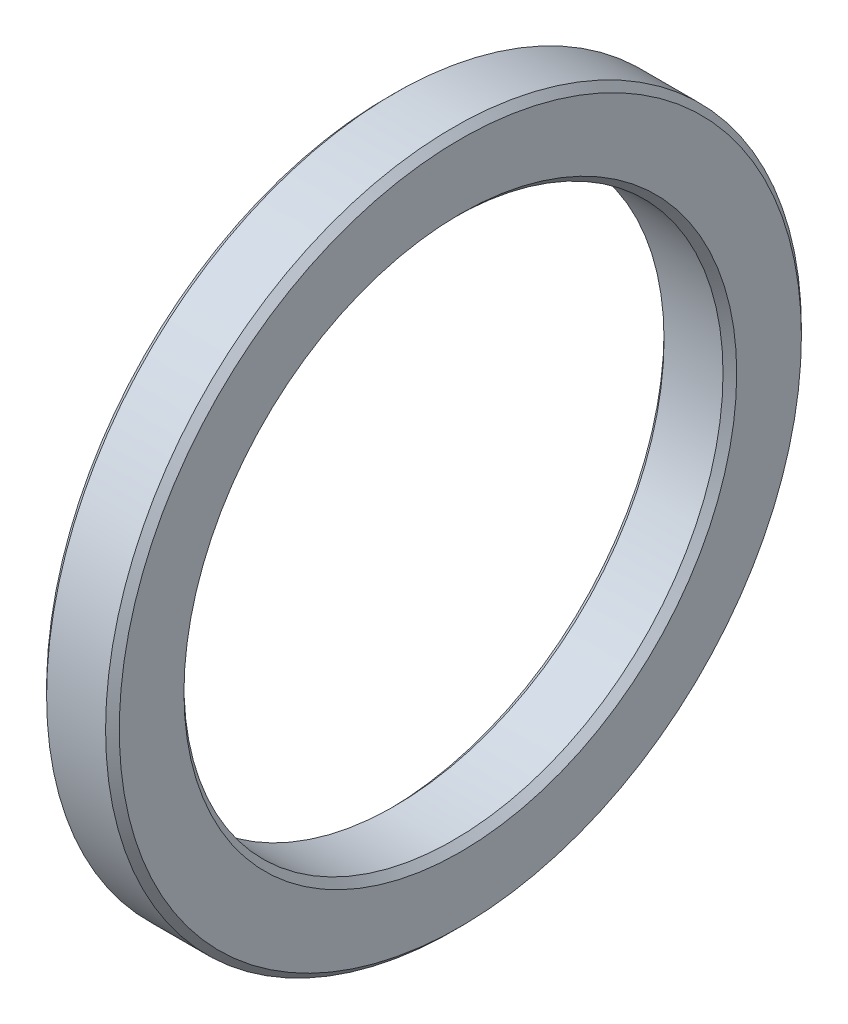
ISO-10303-21;
HEADER;
FILE_DESCRIPTION(('STEP AP214'),'2;1');
FILE_NAME('part.step','',(''),(''),'','','');
FILE_SCHEMA(('AUTOMOTIVE_DESIGN { 1 0 10303 214 1 1 1 1 }'));
ENDSEC;
DATA;
#1=APPLICATION_CONTEXT('core data for automotive mechanical design processes');
#2=APPLICATION_PROTOCOL_DEFINITION('international standard','automotive_design',2000,#1);
#3=PRODUCT_CONTEXT('',#1,'mechanical');
#4=PRODUCT('Part','Part','',(#3));
#5=PRODUCT_RELATED_PRODUCT_CATEGORY('part','',(#4));
#6=PRODUCT_DEFINITION_FORMATION('','',#4);
#7=PRODUCT_DEFINITION_CONTEXT('part definition',#1,'design');
#8=PRODUCT_DEFINITION('design','',#6,#7);
#9=PRODUCT_DEFINITION_SHAPE('','',#8);
#10=(LENGTH_UNIT() NAMED_UNIT(*) SI_UNIT(.MILLI.,.METRE.));
#11=(NAMED_UNIT(*) PLANE_ANGLE_UNIT() SI_UNIT($,.RADIAN.));
#12=(NAMED_UNIT(*) SI_UNIT($,.STERADIAN.) SOLID_ANGLE_UNIT());
#13=UNCERTAINTY_MEASURE_WITH_UNIT(LENGTH_MEASURE(1.E-05),#10,'distance_accuracy_value','');
#14=(GEOMETRIC_REPRESENTATION_CONTEXT(3) GLOBAL_UNCERTAINTY_ASSIGNED_CONTEXT((#13)) GLOBAL_UNIT_ASSIGNED_CONTEXT((#10,
#11,#12)) REPRESENTATION_CONTEXT('',''));
#15=CARTESIAN_POINT('',(0.,0.,0.));
#16=DIRECTION('',(0.,0.,1.));
#17=DIRECTION('',(1.,0.,0.));
#18=AXIS2_PLACEMENT_3D('',#15,#16,#17);
#19=CARTESIAN_POINT('',(6.74,0.,0.));
#20=DIRECTION('',(1.,0.,0.));
#21=DIRECTION('',(0.,0.,-1.));
#22=AXIS2_PLACEMENT_3D('',#19,#20,#21);
#23=PLANE('',#22);
#24=CARTESIAN_POINT('',(6.74,0.,0.));
#25=DIRECTION('',(1.,0.,0.));
#26=DIRECTION('',(0.,0.,-1.));
#27=AXIS2_PLACEMENT_3D('',#24,#25,#26);
#28=CIRCLE('',#27,25.635);
#29=CARTESIAN_POINT('',(6.74,0.,-25.635));
#30=VERTEX_POINT('',#29);
#31=EDGE_CURVE('E10',#30,#30,#28,.F.);
#32=ORIENTED_EDGE('',*,*,#31,.T.);
#33=EDGE_LOOP('',(#32));
#34=FACE_BOUND('',#33,.T.);
#35=CARTESIAN_POINT('',(6.74,0.,0.));
#36=DIRECTION('',(1.,0.,0.));
#37=DIRECTION('',(0.,0.,-1.));
#38=AXIS2_PLACEMENT_3D('',#35,#36,#37);
#39=CIRCLE('',#38,31.635);
#40=CARTESIAN_POINT('',(6.74,0.,-31.635));
#41=VERTEX_POINT('',#40);
#42=EDGE_CURVE('E67',#41,#41,#39,.T.);
#43=ORIENTED_EDGE('',*,*,#42,.T.);
#44=EDGE_LOOP('',(#43));
#45=FACE_BOUND('',#44,.T.);
#46=ADVANCED_FACE('F42',(#34,#45),#23,.T.);
#47=CARTESIAN_POINT('',(0.,0.,0.));
#48=DIRECTION('',(1.,0.,0.));
#49=DIRECTION('',(0.,0.,-1.));
#50=AXIS2_PLACEMENT_3D('',#47,#48,#49);
#51=PLANE('',#50);
#52=CARTESIAN_POINT('',(0.,0.,0.));
#53=DIRECTION('',(1.,0.,0.));
#54=DIRECTION('',(0.,0.,-1.));
#55=AXIS2_PLACEMENT_3D('',#52,#53,#54);
#56=CIRCLE('',#55,25.635);
#57=CARTESIAN_POINT('',(0.,0.,-25.635));
#58=VERTEX_POINT('',#57);
#59=EDGE_CURVE('E61',#58,#58,#56,.T.);
#60=ORIENTED_EDGE('',*,*,#59,.T.);
#61=EDGE_LOOP('',(#60));
#62=FACE_BOUND('',#61,.T.);
#63=CARTESIAN_POINT('',(0.,0.,0.));
#64=DIRECTION('',(1.,0.,0.));
#65=DIRECTION('',(0.,0.,-1.));
#66=AXIS2_PLACEMENT_3D('',#63,#64,#65);
#67=CIRCLE('',#66,31.635);
#68=CARTESIAN_POINT('',(0.,0.,-31.635));
#69=VERTEX_POINT('',#68);
#70=EDGE_CURVE('E71',#69,#69,#67,.F.);
#71=ORIENTED_EDGE('',*,*,#70,.T.);
#72=EDGE_LOOP('',(#71));
#73=FACE_BOUND('',#72,.T.);
#74=ADVANCED_FACE('F95',(#62,#73),#51,.F.);
#75=CARTESIAN_POINT('',(6.74,0.,0.));
#76=DIRECTION('',(-1.,0.,0.));
#77=DIRECTION('',(0.,0.,1.));
#78=AXIS2_PLACEMENT_3D('',#75,#76,#77);
#79=CYLINDRICAL_SURFACE('',#78,32.27);
#80=CARTESIAN_POINT('',(0.634999999999983,0.,0.));
#81=DIRECTION('',(1.,0.,0.));
#82=DIRECTION('',(0.,0.,-1.));
#83=AXIS2_PLACEMENT_3D('',#80,#81,#82);
#84=CIRCLE('',#83,32.27);
#85=CARTESIAN_POINT('',(0.634999999999983,0.,-32.27));
#86=VERTEX_POINT('',#85);
#87=EDGE_CURVE('E75',#86,#86,#84,.T.);
#88=ORIENTED_EDGE('',*,*,#87,.T.);
#89=EDGE_LOOP('',(#88));
#90=FACE_BOUND('',#89,.T.);
#91=CARTESIAN_POINT('',(6.10499999999998,0.,0.));
#92=DIRECTION('',(1.,0.,0.));
#93=DIRECTION('',(0.,0.,-1.));
#94=AXIS2_PLACEMENT_3D('',#91,#92,#93);
#95=CIRCLE('',#94,32.27);
#96=CARTESIAN_POINT('',(6.10499999999998,0.,-32.27));
#97=VERTEX_POINT('',#96);
#98=EDGE_CURVE('E79',#97,#97,#95,.F.);
#99=ORIENTED_EDGE('',*,*,#98,.T.);
#100=EDGE_LOOP('',(#99));
#101=FACE_BOUND('',#100,.T.);
#102=ADVANCED_FACE('F84',(#90,#101),#79,.T.);
#103=CARTESIAN_POINT('',(6.74,0.,0.));
#104=DIRECTION('',(-1.,0.,0.));
#105=DIRECTION('',(0.,0.,1.));
#106=AXIS2_PLACEMENT_3D('',#103,#104,#105);
#107=CYLINDRICAL_SURFACE('',#106,25.);
#108=CARTESIAN_POINT('',(0.63499999999999,0.,0.));
#109=DIRECTION('',(1.,0.,0.));
#110=DIRECTION('',(0.,0.,-1.));
#111=AXIS2_PLACEMENT_3D('',#108,#109,#110);
#112=CIRCLE('',#111,25.);
#113=CARTESIAN_POINT('',(0.63499999999999,0.,-25.));
#114=VERTEX_POINT('',#113);
#115=EDGE_CURVE('E51',#114,#114,#112,.F.);
#116=ORIENTED_EDGE('',*,*,#115,.T.);
#117=EDGE_LOOP('',(#116));
#118=FACE_BOUND('',#117,.T.);
#119=CARTESIAN_POINT('',(6.10499999999999,0.,0.));
#120=DIRECTION('',(1.,0.,0.));
#121=DIRECTION('',(0.,0.,-1.));
#122=AXIS2_PLACEMENT_3D('',#119,#120,#121);
#123=CIRCLE('',#122,25.);
#124=CARTESIAN_POINT('',(6.10499999999999,0.,-25.));
#125=VERTEX_POINT('',#124);
#126=EDGE_CURVE('E56',#125,#125,#123,.T.);
#127=ORIENTED_EDGE('',*,*,#126,.T.);
#128=EDGE_LOOP('',(#127));
#129=FACE_BOUND('',#128,.T.);
#130=ADVANCED_FACE('F104',(#118,#129),#107,.F.);
#131=CARTESIAN_POINT('',(0.634999999999983,0.,0.));
#132=DIRECTION('',(1.,0.,0.));
#133=DIRECTION('',(0.,0.,-1.));
#134=AXIS2_PLACEMENT_3D('',#131,#132,#133);
#135=CONICAL_SURFACE('',#134,32.27,0.785398163397454);
#136=ORIENTED_EDGE('',*,*,#70,.F.);
#137=EDGE_LOOP('',(#136));
#138=FACE_BOUND('',#137,.T.);
#139=ORIENTED_EDGE('',*,*,#87,.F.);
#140=EDGE_LOOP('',(#139));
#141=FACE_BOUND('',#140,.T.);
#142=ADVANCED_FACE('F90',(#138,#141),#135,.T.);
#143=CARTESIAN_POINT('',(6.74,0.,0.));
#144=DIRECTION('',(-1.,0.,0.));
#145=DIRECTION('',(0.,0.,1.));
#146=AXIS2_PLACEMENT_3D('',#143,#144,#145);
#147=CONICAL_SURFACE('',#146,31.635,0.785398163397437);
#148=ORIENTED_EDGE('',*,*,#98,.F.);
#149=EDGE_LOOP('',(#148));
#150=FACE_BOUND('',#149,.T.);
#151=ORIENTED_EDGE('',*,*,#42,.F.);
#152=EDGE_LOOP('',(#151));
#153=FACE_BOUND('',#152,.T.);
#154=ADVANCED_FACE('F86',(#150,#153),#147,.T.);
#155=CARTESIAN_POINT('',(0.,0.,0.));
#156=DIRECTION('',(-1.,0.,0.));
#157=DIRECTION('',(0.,0.,1.));
#158=AXIS2_PLACEMENT_3D('',#155,#156,#157);
#159=CONICAL_SURFACE('',#158,25.635,0.785398163397443);
#160=ORIENTED_EDGE('',*,*,#115,.F.);
#161=EDGE_LOOP('',(#160));
#162=FACE_BOUND('',#161,.T.);
#163=ORIENTED_EDGE('',*,*,#59,.F.);
#164=EDGE_LOOP('',(#163));
#165=FACE_BOUND('',#164,.T.);
#166=ADVANCED_FACE('F89',(#162,#165),#159,.F.);
#167=CARTESIAN_POINT('',(6.10499999999999,0.,0.));
#168=DIRECTION('',(1.,0.,0.));
#169=DIRECTION('',(0.,0.,-1.));
#170=AXIS2_PLACEMENT_3D('',#167,#168,#169);
#171=CONICAL_SURFACE('',#170,25.,0.785398163397443);
#172=ORIENTED_EDGE('',*,*,#31,.F.);
#173=EDGE_LOOP('',(#172));
#174=FACE_BOUND('',#173,.T.);
#175=ORIENTED_EDGE('',*,*,#126,.F.);
#176=EDGE_LOOP('',(#175));
#177=FACE_BOUND('',#176,.T.);
#178=ADVANCED_FACE('F45',(#174,#177),#171,.F.);
#179=CLOSED_SHELL('',(#46,#74,#102,#130,#142,#154,#166,#178));
#180=MANIFOLD_SOLID_BREP('B2',#179);
#181=ADVANCED_BREP_SHAPE_REPRESENTATION('',(#18,#180),#14);
#182=SHAPE_DEFINITION_REPRESENTATION(#9,#181);
ENDSEC;
END-ISO-10303-21;
